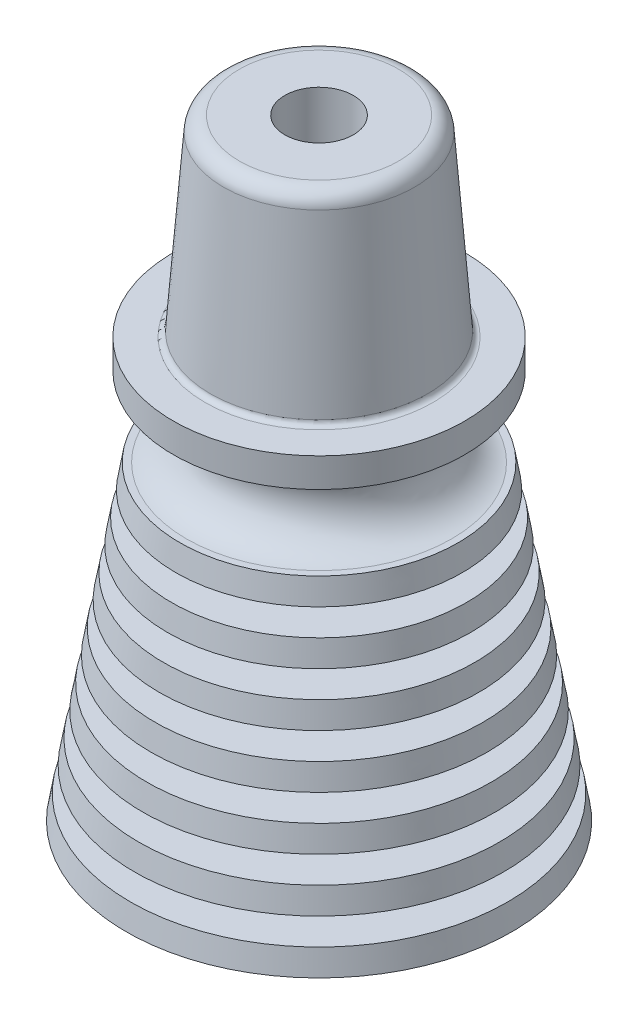
ISO-10303-21;
HEADER;
FILE_DESCRIPTION(('STEP AP214'),'2;1');
FILE_NAME('part.step','',(''),(''),'','','');
FILE_SCHEMA(('AUTOMOTIVE_DESIGN { 1 0 10303 214 1 1 1 1 }'));
ENDSEC;
DATA;
#1=APPLICATION_CONTEXT('core data for automotive mechanical design processes');
#2=APPLICATION_PROTOCOL_DEFINITION('international standard','automotive_design',2000,#1);
#3=PRODUCT_CONTEXT('',#1,'mechanical');
#4=PRODUCT('Part','Part','',(#3));
#5=PRODUCT_RELATED_PRODUCT_CATEGORY('part','',(#4));
#6=PRODUCT_DEFINITION_FORMATION('','',#4);
#7=PRODUCT_DEFINITION_CONTEXT('part definition',#1,'design');
#8=PRODUCT_DEFINITION('design','',#6,#7);
#9=PRODUCT_DEFINITION_SHAPE('','',#8);
#10=(LENGTH_UNIT() NAMED_UNIT(*) SI_UNIT(.MILLI.,.METRE.));
#11=(NAMED_UNIT(*) PLANE_ANGLE_UNIT() SI_UNIT($,.RADIAN.));
#12=(NAMED_UNIT(*) SI_UNIT($,.STERADIAN.) SOLID_ANGLE_UNIT());
#13=UNCERTAINTY_MEASURE_WITH_UNIT(LENGTH_MEASURE(1.E-05),#10,'distance_accuracy_value','');
#14=(GEOMETRIC_REPRESENTATION_CONTEXT(3) GLOBAL_UNCERTAINTY_ASSIGNED_CONTEXT((#13)) GLOBAL_UNIT_ASSIGNED_CONTEXT((#10,
#11,#12)) REPRESENTATION_CONTEXT('',''));
#15=CARTESIAN_POINT('',(0.,0.,0.));
#16=DIRECTION('',(0.,0.,1.));
#17=DIRECTION('',(1.,0.,0.));
#18=AXIS2_PLACEMENT_3D('',#15,#16,#17);
#19=CARTESIAN_POINT('',(0.,0.,0.));
#20=DIRECTION('',(0.,-1.,0.));
#21=DIRECTION('',(0.,0.,-1.));
#22=AXIS2_PLACEMENT_3D('',#19,#20,#21);
#23=CONICAL_SURFACE('',#22,6.23569725419736,0.111501419453793);
#24=CARTESIAN_POINT('',(0.,12.573,0.));
#25=DIRECTION('',(0.,1.,0.));
#26=DIRECTION('',(0.,0.,1.));
#27=AXIS2_PLACEMENT_3D('',#24,#25,#26);
#28=CIRCLE('',#27,4.82795110035121);
#29=CARTESIAN_POINT('',(0.,12.573,4.82795110035121));
#30=VERTEX_POINT('',#29);
#31=EDGE_CURVE('E55',#30,#30,#28,.F.);
#32=ORIENTED_EDGE('',*,*,#31,.F.);
#33=EDGE_LOOP('',(#32));
#34=FACE_BOUND('',#33,.T.);
#35=CARTESIAN_POINT('',(0.,13.716,0.));
#36=DIRECTION('',(0.,-1.,0.));
#37=DIRECTION('',(0.,0.,-1.));
#38=AXIS2_PLACEMENT_3D('',#35,#36,#37);
#39=CIRCLE('',#38,4.69997417727428);
#40=CARTESIAN_POINT('',(0.,13.716,-4.69997417727428));
#41=VERTEX_POINT('',#40);
#42=EDGE_CURVE('E88',#41,#41,#39,.F.);
#43=ORIENTED_EDGE('',*,*,#42,.F.);
#44=EDGE_LOOP('',(#43));
#45=FACE_BOUND('',#44,.T.);
#46=ADVANCED_FACE('F32',(#34,#45),#23,.T.);
#47=CARTESIAN_POINT('',(0.,9.144,0.));
#48=DIRECTION('',(0.,-1.,0.));
#49=DIRECTION('',(0.,0.,-1.));
#50=AXIS2_PLACEMENT_3D('',#47,#48,#49);
#51=CIRCLE('',#50,5.21188186958198);
#52=CARTESIAN_POINT('',(0.,9.144,-5.21188186958198));
#53=VERTEX_POINT('',#52);
#54=EDGE_CURVE('E61',#53,#53,#51,.F.);
#55=ORIENTED_EDGE('',*,*,#54,.F.);
#56=EDGE_LOOP('',(#55));
#57=FACE_BOUND('',#56,.T.);
#58=CARTESIAN_POINT('',(0.,8.001,0.));
#59=DIRECTION('',(0.,1.,0.));
#60=DIRECTION('',(0.,0.,1.));
#61=AXIS2_PLACEMENT_3D('',#58,#59,#60);
#62=CIRCLE('',#61,5.3398587926589);
#63=CARTESIAN_POINT('',(0.,8.001,5.3398587926589));
#64=VERTEX_POINT('',#63);
#65=EDGE_CURVE('E67',#64,#64,#62,.F.);
#66=ORIENTED_EDGE('',*,*,#65,.F.);
#67=EDGE_LOOP('',(#66));
#68=FACE_BOUND('',#67,.T.);
#69=ADVANCED_FACE('F172',(#57,#68),#23,.T.);
#70=CARTESIAN_POINT('',(0.,11.43,0.));
#71=DIRECTION('',(0.,-1.,0.));
#72=DIRECTION('',(0.,0.,-1.));
#73=AXIS2_PLACEMENT_3D('',#70,#71,#72);
#74=CIRCLE('',#73,4.95592802342813);
#75=CARTESIAN_POINT('',(0.,11.43,-4.95592802342813));
#76=VERTEX_POINT('',#75);
#77=EDGE_CURVE('E58',#76,#76,#74,.F.);
#78=ORIENTED_EDGE('',*,*,#77,.F.);
#79=EDGE_LOOP('',(#78));
#80=FACE_BOUND('',#79,.T.);
#81=CARTESIAN_POINT('',(0.,10.287,0.));
#82=DIRECTION('',(0.,1.,0.));
#83=DIRECTION('',(0.,0.,1.));
#84=AXIS2_PLACEMENT_3D('',#81,#82,#83);
#85=CIRCLE('',#84,5.08390494650505);
#86=CARTESIAN_POINT('',(0.,10.287,5.08390494650505));
#87=VERTEX_POINT('',#86);
#88=EDGE_CURVE('E64',#87,#87,#85,.F.);
#89=ORIENTED_EDGE('',*,*,#88,.F.);
#90=EDGE_LOOP('',(#89));
#91=FACE_BOUND('',#90,.T.);
#92=ADVANCED_FACE('F179',(#80,#91),#23,.T.);
#93=CARTESIAN_POINT('',(0.,6.858,0.));
#94=DIRECTION('',(0.,-1.,0.));
#95=DIRECTION('',(0.,0.,-1.));
#96=AXIS2_PLACEMENT_3D('',#93,#94,#95);
#97=CIRCLE('',#96,5.46783571573582);
#98=CARTESIAN_POINT('',(0.,6.858,-5.46783571573582));
#99=VERTEX_POINT('',#98);
#100=EDGE_CURVE('E70',#99,#99,#97,.F.);
#101=ORIENTED_EDGE('',*,*,#100,.F.);
#102=EDGE_LOOP('',(#101));
#103=FACE_BOUND('',#102,.T.);
#104=CARTESIAN_POINT('',(0.,5.715,0.));
#105=DIRECTION('',(0.,1.,0.));
#106=DIRECTION('',(0.,0.,1.));
#107=AXIS2_PLACEMENT_3D('',#104,#105,#106);
#108=CIRCLE('',#107,5.59581263881275);
#109=CARTESIAN_POINT('',(0.,5.715,5.59581263881275));
#110=VERTEX_POINT('',#109);
#111=EDGE_CURVE('E73',#110,#110,#108,.F.);
#112=ORIENTED_EDGE('',*,*,#111,.F.);
#113=EDGE_LOOP('',(#112));
#114=FACE_BOUND('',#113,.T.);
#115=ADVANCED_FACE('F201',(#103,#114),#23,.T.);
#116=CARTESIAN_POINT('',(0.,4.572,0.));
#117=DIRECTION('',(0.,-1.,0.));
#118=DIRECTION('',(0.,0.,-1.));
#119=AXIS2_PLACEMENT_3D('',#116,#117,#118);
#120=CIRCLE('',#119,5.72378956188967);
#121=CARTESIAN_POINT('',(0.,4.572,-5.72378956188967));
#122=VERTEX_POINT('',#121);
#123=EDGE_CURVE('E76',#122,#122,#120,.F.);
#124=ORIENTED_EDGE('',*,*,#123,.F.);
#125=EDGE_LOOP('',(#124));
#126=FACE_BOUND('',#125,.T.);
#127=CARTESIAN_POINT('',(0.,3.429,0.));
#128=DIRECTION('',(0.,1.,0.));
#129=DIRECTION('',(0.,0.,1.));
#130=AXIS2_PLACEMENT_3D('',#127,#128,#129);
#131=CIRCLE('',#130,5.85176648496659);
#132=CARTESIAN_POINT('',(0.,3.429,5.85176648496659));
#133=VERTEX_POINT('',#132);
#134=EDGE_CURVE('E79',#133,#133,#131,.F.);
#135=ORIENTED_EDGE('',*,*,#134,.F.);
#136=EDGE_LOOP('',(#135));
#137=FACE_BOUND('',#136,.T.);
#138=ADVANCED_FACE('F189',(#126,#137),#23,.T.);
#139=CARTESIAN_POINT('',(0.,14.859,0.));
#140=DIRECTION('',(0.,-1.,0.));
#141=DIRECTION('',(0.,0.,-1.));
#142=AXIS2_PLACEMENT_3D('',#139,#140,#141);
#143=CONICAL_SURFACE('',#142,2.5273,0.111501419453793);
#144=CARTESIAN_POINT('',(0.,0.,0.));
#145=DIRECTION('',(0.,-1.,0.));
#146=DIRECTION('',(0.,0.,-1.));
#147=AXIS2_PLACEMENT_3D('',#144,#145,#146);
#148=CIRCLE('',#147,4.191);
#149=CARTESIAN_POINT('',(0.,0.,-4.191));
#150=VERTEX_POINT('',#149);
#151=EDGE_CURVE('E91',#150,#150,#148,.T.);
#152=ORIENTED_EDGE('',*,*,#151,.T.);
#153=EDGE_LOOP('',(#152));
#154=FACE_BOUND('',#153,.T.);
#155=CARTESIAN_POINT('',(0.,14.859,0.));
#156=DIRECTION('',(0.,-1.,0.));
#157=DIRECTION('',(0.,0.,-1.));
#158=AXIS2_PLACEMENT_3D('',#155,#156,#157);
#159=CIRCLE('',#158,2.5273);
#160=CARTESIAN_POINT('',(0.,14.859,-2.5273));
#161=VERTEX_POINT('',#160);
#162=EDGE_CURVE('E94',#161,#161,#159,.T.);
#163=ORIENTED_EDGE('',*,*,#162,.F.);
#164=EDGE_LOOP('',(#163));
#165=FACE_BOUND('',#164,.T.);
#166=ADVANCED_FACE('F196',(#154,#165),#143,.F.);
#167=CARTESIAN_POINT('',(4.191,0.,0.));
#168=DIRECTION('',(0.,-1.,0.));
#169=DIRECTION('',(0.,0.,-1.));
#170=AXIS2_PLACEMENT_3D('',#167,#168,#169);
#171=PLANE('',#170);
#172=ORIENTED_EDGE('',*,*,#151,.F.);
#173=EDGE_LOOP('',(#172));
#174=FACE_BOUND('',#173,.T.);
#175=CARTESIAN_POINT('',(0.,0.,0.));
#176=DIRECTION('',(0.,-1.,0.));
#177=DIRECTION('',(0.,0.,-1.));
#178=AXIS2_PLACEMENT_3D('',#175,#176,#177);
#179=CIRCLE('',#178,9.2329);
#180=CARTESIAN_POINT('',(0.,0.,-9.2329));
#181=VERTEX_POINT('',#180);
#182=EDGE_CURVE('E106',#181,#181,#179,.T.);
#183=ORIENTED_EDGE('',*,*,#182,.T.);
#184=EDGE_LOOP('',(#183));
#185=FACE_BOUND('',#184,.T.);
#186=ADVANCED_FACE('F187',(#174,#185),#171,.T.);
#187=CARTESIAN_POINT('',(0.,2.286,0.));
#188=DIRECTION('',(0.,-1.,0.));
#189=DIRECTION('',(0.,0.,-1.));
#190=AXIS2_PLACEMENT_3D('',#187,#188,#189);
#191=CIRCLE('',#190,5.97974340804351);
#192=CARTESIAN_POINT('',(0.,2.286,-5.97974340804351));
#193=VERTEX_POINT('',#192);
#194=EDGE_CURVE('E82',#193,#193,#191,.F.);
#195=ORIENTED_EDGE('',*,*,#194,.F.);
#196=EDGE_LOOP('',(#195));
#197=FACE_BOUND('',#196,.T.);
#198=CARTESIAN_POINT('',(0.,1.143,0.));
#199=DIRECTION('',(0.,1.,0.));
#200=DIRECTION('',(0.,0.,1.));
#201=AXIS2_PLACEMENT_3D('',#198,#199,#200);
#202=CIRCLE('',#201,6.10772033112044);
#203=CARTESIAN_POINT('',(0.,1.143,6.10772033112044));
#204=VERTEX_POINT('',#203);
#205=EDGE_CURVE('E85',#204,#204,#202,.F.);
#206=ORIENTED_EDGE('',*,*,#205,.F.);
#207=EDGE_LOOP('',(#206));
#208=FACE_BOUND('',#207,.T.);
#209=ADVANCED_FACE('F175',(#197,#208),#23,.T.);
#210=CARTESIAN_POINT('',(4.57199725419736,14.859,0.));
#211=DIRECTION('',(0.,1.,0.));
#212=DIRECTION('',(0.,0.,1.));
#213=AXIS2_PLACEMENT_3D('',#210,#211,#212);
#214=PLANE('',#213);
#215=CARTESIAN_POINT('',(0.,14.859,0.));
#216=DIRECTION('',(0.,-1.,0.));
#217=DIRECTION('',(0.,0.,-1.));
#218=AXIS2_PLACEMENT_3D('',#215,#216,#217);
#219=CIRCLE('',#218,6.35000000000002);
#220=CARTESIAN_POINT('',(0.,14.859,-6.35000000000002));
#221=VERTEX_POINT('',#220);
#222=EDGE_CURVE('E52',#221,#221,#219,.F.);
#223=ORIENTED_EDGE('',*,*,#222,.F.);
#224=EDGE_LOOP('',(#223));
#225=FACE_BOUND('',#224,.T.);
#226=CARTESIAN_POINT('',(0.,14.859,0.));
#227=DIRECTION('',(0.,-1.,0.));
#228=DIRECTION('',(0.,0.,-1.));
#229=AXIS2_PLACEMENT_3D('',#226,#227,#228);
#230=CIRCLE('',#229,6.6675);
#231=CARTESIAN_POINT('',(0.,14.859,-6.6675));
#232=VERTEX_POINT('',#231);
#233=EDGE_CURVE('E97',#232,#232,#230,.T.);
#234=ORIENTED_EDGE('',*,*,#233,.F.);
#235=EDGE_LOOP('',(#234));
#236=FACE_BOUND('',#235,.T.);
#237=ADVANCED_FACE('F186',(#225,#236),#214,.T.);
#238=CARTESIAN_POINT('',(0.,13.716,0.));
#239=DIRECTION('',(0.,-1.,0.));
#240=DIRECTION('',(0.,0.,-1.));
#241=AXIS2_PLACEMENT_3D('',#238,#239,#240);
#242=CONICAL_SURFACE('',#241,6.86483846153846,0.170964175409462);
#243=ORIENTED_EDGE('',*,*,#233,.T.);
#244=EDGE_LOOP('',(#243));
#245=FACE_BOUND('',#244,.T.);
#246=CARTESIAN_POINT('',(0.,13.716,0.));
#247=DIRECTION('',(0.,-1.,0.));
#248=DIRECTION('',(0.,0.,-1.));
#249=AXIS2_PLACEMENT_3D('',#246,#247,#248);
#250=CIRCLE('',#249,6.86483846153846);
#251=CARTESIAN_POINT('',(0.,13.716,-6.86483846153846));
#252=VERTEX_POINT('',#251);
#253=EDGE_CURVE('E100',#252,#252,#250,.T.);
#254=ORIENTED_EDGE('',*,*,#253,.F.);
#255=EDGE_LOOP('',(#254));
#256=FACE_BOUND('',#255,.T.);
#257=ADVANCED_FACE('F194',(#245,#256),#242,.T.);
#258=CARTESIAN_POINT('',(4.69997417727428,13.716,0.));
#259=DIRECTION('',(0.,-1.,0.));
#260=DIRECTION('',(0.,0.,-1.));
#261=AXIS2_PLACEMENT_3D('',#258,#259,#260);
#262=PLANE('',#261);
#263=ORIENTED_EDGE('',*,*,#253,.T.);
#264=EDGE_LOOP('',(#263));
#265=FACE_BOUND('',#264,.T.);
#266=ORIENTED_EDGE('',*,*,#42,.T.);
#267=EDGE_LOOP('',(#266));
#268=FACE_BOUND('',#267,.T.);
#269=ADVANCED_FACE('F246',(#265,#268),#262,.T.);
#270=CARTESIAN_POINT('',(0.,0.,0.));
#271=DIRECTION('',(0.,-1.,0.));
#272=DIRECTION('',(0.,0.,-1.));
#273=AXIS2_PLACEMENT_3D('',#270,#271,#272);
#274=CONICAL_SURFACE('',#273,9.2329,0.170964175409462);
#275=CARTESIAN_POINT('',(0.,1.143,0.));
#276=DIRECTION('',(0.,-1.,0.));
#277=DIRECTION('',(0.,0.,-1.));
#278=AXIS2_PLACEMENT_3D('',#275,#276,#277);
#279=CIRCLE('',#278,9.03556153846154);
#280=CARTESIAN_POINT('',(0.,1.143,-9.03556153846154));
#281=VERTEX_POINT('',#280);
#282=EDGE_CURVE('E103',#281,#281,#279,.T.);
#283=ORIENTED_EDGE('',*,*,#282,.T.);
#284=EDGE_LOOP('',(#283));
#285=FACE_BOUND('',#284,.T.);
#286=ORIENTED_EDGE('',*,*,#182,.F.);
#287=EDGE_LOOP('',(#286));
#288=FACE_BOUND('',#287,.T.);
#289=ADVANCED_FACE('F242',(#285,#288),#274,.T.);
#290=CARTESIAN_POINT('',(6.10772033112044,1.143,0.));
#291=DIRECTION('',(0.,1.,0.));
#292=DIRECTION('',(0.,0.,1.));
#293=AXIS2_PLACEMENT_3D('',#290,#291,#292);
#294=PLANE('',#293);
#295=ORIENTED_EDGE('',*,*,#205,.T.);
#296=EDGE_LOOP('',(#295));
#297=FACE_BOUND('',#296,.T.);
#298=ORIENTED_EDGE('',*,*,#282,.F.);
#299=EDGE_LOOP('',(#298));
#300=FACE_BOUND('',#299,.T.);
#301=ADVANCED_FACE('F224',(#297,#300),#294,.T.);
#302=CARTESIAN_POINT('',(0.,2.286,0.));
#303=DIRECTION('',(0.,-1.,0.));
#304=DIRECTION('',(0.,0.,-1.));
#305=AXIS2_PLACEMENT_3D('',#302,#303,#304);
#306=CONICAL_SURFACE('',#305,8.83822307692308,0.170964175409462);
#307=CARTESIAN_POINT('',(0.,3.429,0.));
#308=DIRECTION('',(0.,-1.,0.));
#309=DIRECTION('',(0.,0.,-1.));
#310=AXIS2_PLACEMENT_3D('',#307,#308,#309);
#311=CIRCLE('',#310,8.64088461538461);
#312=CARTESIAN_POINT('',(0.,3.429,-8.64088461538461));
#313=VERTEX_POINT('',#312);
#314=EDGE_CURVE('E109',#313,#313,#311,.T.);
#315=ORIENTED_EDGE('',*,*,#314,.T.);
#316=EDGE_LOOP('',(#315));
#317=FACE_BOUND('',#316,.T.);
#318=CARTESIAN_POINT('',(0.,2.286,0.));
#319=DIRECTION('',(0.,-1.,0.));
#320=DIRECTION('',(0.,0.,-1.));
#321=AXIS2_PLACEMENT_3D('',#318,#319,#320);
#322=CIRCLE('',#321,8.83822307692308);
#323=CARTESIAN_POINT('',(0.,2.286,-8.83822307692308));
#324=VERTEX_POINT('',#323);
#325=EDGE_CURVE('E112',#324,#324,#322,.T.);
#326=ORIENTED_EDGE('',*,*,#325,.F.);
#327=EDGE_LOOP('',(#326));
#328=FACE_BOUND('',#327,.T.);
#329=ADVANCED_FACE('F218',(#317,#328),#306,.T.);
#330=CARTESIAN_POINT('',(5.85176648496659,3.429,0.));
#331=DIRECTION('',(0.,1.,0.));
#332=DIRECTION('',(0.,0.,1.));
#333=AXIS2_PLACEMENT_3D('',#330,#331,#332);
#334=PLANE('',#333);
#335=ORIENTED_EDGE('',*,*,#134,.T.);
#336=EDGE_LOOP('',(#335));
#337=FACE_BOUND('',#336,.T.);
#338=ORIENTED_EDGE('',*,*,#314,.F.);
#339=EDGE_LOOP('',(#338));
#340=FACE_BOUND('',#339,.T.);
#341=ADVANCED_FACE('F214',(#337,#340),#334,.T.);
#342=CARTESIAN_POINT('',(5.97974340804352,2.286,0.));
#343=DIRECTION('',(0.,-1.,0.));
#344=DIRECTION('',(0.,0.,-1.));
#345=AXIS2_PLACEMENT_3D('',#342,#343,#344);
#346=PLANE('',#345);
#347=ORIENTED_EDGE('',*,*,#325,.T.);
#348=EDGE_LOOP('',(#347));
#349=FACE_BOUND('',#348,.T.);
#350=ORIENTED_EDGE('',*,*,#194,.T.);
#351=EDGE_LOOP('',(#350));
#352=FACE_BOUND('',#351,.T.);
#353=ADVANCED_FACE('F217',(#349,#352),#346,.T.);
#354=CARTESIAN_POINT('',(0.,4.572,0.));
#355=DIRECTION('',(0.,-1.,0.));
#356=DIRECTION('',(0.,0.,-1.));
#357=AXIS2_PLACEMENT_3D('',#354,#355,#356);
#358=CONICAL_SURFACE('',#357,8.44354615384615,0.17096417540946);
#359=CARTESIAN_POINT('',(0.,5.715,0.));
#360=DIRECTION('',(0.,-1.,0.));
#361=DIRECTION('',(0.,0.,-1.));
#362=AXIS2_PLACEMENT_3D('',#359,#360,#361);
#363=CIRCLE('',#362,8.24620769230769);
#364=CARTESIAN_POINT('',(0.,5.715,-8.24620769230769));
#365=VERTEX_POINT('',#364);
#366=EDGE_CURVE('E115',#365,#365,#363,.T.);
#367=ORIENTED_EDGE('',*,*,#366,.T.);
#368=EDGE_LOOP('',(#367));
#369=FACE_BOUND('',#368,.T.);
#370=CARTESIAN_POINT('',(0.,4.572,0.));
#371=DIRECTION('',(0.,-1.,0.));
#372=DIRECTION('',(0.,0.,-1.));
#373=AXIS2_PLACEMENT_3D('',#370,#371,#372);
#374=CIRCLE('',#373,8.44354615384615);
#375=CARTESIAN_POINT('',(0.,4.572,-8.44354615384615));
#376=VERTEX_POINT('',#375);
#377=EDGE_CURVE('E118',#376,#376,#374,.T.);
#378=ORIENTED_EDGE('',*,*,#377,.F.);
#379=EDGE_LOOP('',(#378));
#380=FACE_BOUND('',#379,.T.);
#381=ADVANCED_FACE('F230',(#369,#380),#358,.T.);
#382=CARTESIAN_POINT('',(5.59581263881275,5.715,0.));
#383=DIRECTION('',(0.,1.,0.));
#384=DIRECTION('',(0.,0.,1.));
#385=AXIS2_PLACEMENT_3D('',#382,#383,#384);
#386=PLANE('',#385);
#387=ORIENTED_EDGE('',*,*,#111,.T.);
#388=EDGE_LOOP('',(#387));
#389=FACE_BOUND('',#388,.T.);
#390=ORIENTED_EDGE('',*,*,#366,.F.);
#391=EDGE_LOOP('',(#390));
#392=FACE_BOUND('',#391,.T.);
#393=ADVANCED_FACE('F235',(#389,#392),#386,.T.);
#394=CARTESIAN_POINT('',(5.72378956188967,4.572,0.));
#395=DIRECTION('',(0.,-1.,0.));
#396=DIRECTION('',(0.,0.,-1.));
#397=AXIS2_PLACEMENT_3D('',#394,#395,#396);
#398=PLANE('',#397);
#399=ORIENTED_EDGE('',*,*,#377,.T.);
#400=EDGE_LOOP('',(#399));
#401=FACE_BOUND('',#400,.T.);
#402=ORIENTED_EDGE('',*,*,#123,.T.);
#403=EDGE_LOOP('',(#402));
#404=FACE_BOUND('',#403,.T.);
#405=ADVANCED_FACE('F302',(#401,#404),#398,.T.);
#406=CARTESIAN_POINT('',(0.,6.858,0.));
#407=DIRECTION('',(0.,-1.,0.));
#408=DIRECTION('',(0.,0.,-1.));
#409=AXIS2_PLACEMENT_3D('',#406,#407,#408);
#410=CONICAL_SURFACE('',#409,8.04886923076923,0.170964175409462);
#411=CARTESIAN_POINT('',(0.,8.001,0.));
#412=DIRECTION('',(0.,-1.,0.));
#413=DIRECTION('',(0.,0.,-1.));
#414=AXIS2_PLACEMENT_3D('',#411,#412,#413);
#415=CIRCLE('',#414,7.85153076923077);
#416=CARTESIAN_POINT('',(0.,8.001,-7.85153076923077));
#417=VERTEX_POINT('',#416);
#418=EDGE_CURVE('E121',#417,#417,#415,.T.);
#419=ORIENTED_EDGE('',*,*,#418,.T.);
#420=EDGE_LOOP('',(#419));
#421=FACE_BOUND('',#420,.T.);
#422=CARTESIAN_POINT('',(0.,6.858,0.));
#423=DIRECTION('',(0.,-1.,0.));
#424=DIRECTION('',(0.,0.,-1.));
#425=AXIS2_PLACEMENT_3D('',#422,#423,#424);
#426=CIRCLE('',#425,8.04886923076923);
#427=CARTESIAN_POINT('',(0.,6.858,-8.04886923076923));
#428=VERTEX_POINT('',#427);
#429=EDGE_CURVE('E124',#428,#428,#426,.T.);
#430=ORIENTED_EDGE('',*,*,#429,.F.);
#431=EDGE_LOOP('',(#430));
#432=FACE_BOUND('',#431,.T.);
#433=ADVANCED_FACE('F311',(#421,#432),#410,.T.);
#434=CARTESIAN_POINT('',(5.3398587926589,8.001,0.));
#435=DIRECTION('',(0.,1.,0.));
#436=DIRECTION('',(0.,0.,1.));
#437=AXIS2_PLACEMENT_3D('',#434,#435,#436);
#438=PLANE('',#437);
#439=ORIENTED_EDGE('',*,*,#65,.T.);
#440=EDGE_LOOP('',(#439));
#441=FACE_BOUND('',#440,.T.);
#442=ORIENTED_EDGE('',*,*,#418,.F.);
#443=EDGE_LOOP('',(#442));
#444=FACE_BOUND('',#443,.T.);
#445=ADVANCED_FACE('F321',(#441,#444),#438,.T.);
#446=CARTESIAN_POINT('',(5.46783571573582,6.858,0.));
#447=DIRECTION('',(0.,-1.,0.));
#448=DIRECTION('',(0.,0.,-1.));
#449=AXIS2_PLACEMENT_3D('',#446,#447,#448);
#450=PLANE('',#449);
#451=ORIENTED_EDGE('',*,*,#429,.T.);
#452=EDGE_LOOP('',(#451));
#453=FACE_BOUND('',#452,.T.);
#454=ORIENTED_EDGE('',*,*,#100,.T.);
#455=EDGE_LOOP('',(#454));
#456=FACE_BOUND('',#455,.T.);
#457=ADVANCED_FACE('F331',(#453,#456),#450,.T.);
#458=CARTESIAN_POINT('',(5.21188186958198,9.144,0.));
#459=DIRECTION('',(0.,-1.,0.));
#460=DIRECTION('',(0.,0.,-1.));
#461=AXIS2_PLACEMENT_3D('',#458,#459,#460);
#462=PLANE('',#461);
#463=CARTESIAN_POINT('',(0.,9.144,0.));
#464=DIRECTION('',(0.,-1.,0.));
#465=DIRECTION('',(0.,0.,-1.));
#466=AXIS2_PLACEMENT_3D('',#463,#464,#465);
#467=CIRCLE('',#466,7.65419230769231);
#468=CARTESIAN_POINT('',(0.,9.144,-7.65419230769231));
#469=VERTEX_POINT('',#468);
#470=EDGE_CURVE('E127',#469,#469,#467,.T.);
#471=ORIENTED_EDGE('',*,*,#470,.T.);
#472=EDGE_LOOP('',(#471));
#473=FACE_BOUND('',#472,.T.);
#474=ORIENTED_EDGE('',*,*,#54,.T.);
#475=EDGE_LOOP('',(#474));
#476=FACE_BOUND('',#475,.T.);
#477=ADVANCED_FACE('F341',(#473,#476),#462,.T.);
#478=CARTESIAN_POINT('',(0.,9.144,0.));
#479=DIRECTION('',(0.,-1.,0.));
#480=DIRECTION('',(0.,0.,-1.));
#481=AXIS2_PLACEMENT_3D('',#478,#479,#480);
#482=CONICAL_SURFACE('',#481,7.65419230769231,0.170964175409462);
#483=CARTESIAN_POINT('',(0.,10.287,0.));
#484=DIRECTION('',(0.,-1.,0.));
#485=DIRECTION('',(0.,0.,-1.));
#486=AXIS2_PLACEMENT_3D('',#483,#484,#485);
#487=CIRCLE('',#486,7.45685384615385);
#488=CARTESIAN_POINT('',(0.,10.287,-7.45685384615385));
#489=VERTEX_POINT('',#488);
#490=EDGE_CURVE('E130',#489,#489,#487,.T.);
#491=ORIENTED_EDGE('',*,*,#490,.T.);
#492=EDGE_LOOP('',(#491));
#493=FACE_BOUND('',#492,.T.);
#494=ORIENTED_EDGE('',*,*,#470,.F.);
#495=EDGE_LOOP('',(#494));
#496=FACE_BOUND('',#495,.T.);
#497=ADVANCED_FACE('F351',(#493,#496),#482,.T.);
#498=CARTESIAN_POINT('',(5.08390494650505,10.287,0.));
#499=DIRECTION('',(0.,1.,0.));
#500=DIRECTION('',(0.,0.,1.));
#501=AXIS2_PLACEMENT_3D('',#498,#499,#500);
#502=PLANE('',#501);
#503=ORIENTED_EDGE('',*,*,#88,.T.);
#504=EDGE_LOOP('',(#503));
#505=FACE_BOUND('',#504,.T.);
#506=ORIENTED_EDGE('',*,*,#490,.F.);
#507=EDGE_LOOP('',(#506));
#508=FACE_BOUND('',#507,.T.);
#509=ADVANCED_FACE('F361',(#505,#508),#502,.T.);
#510=CARTESIAN_POINT('',(0.,11.43,0.));
#511=DIRECTION('',(0.,-1.,0.));
#512=DIRECTION('',(0.,0.,-1.));
#513=AXIS2_PLACEMENT_3D('',#510,#511,#512);
#514=CONICAL_SURFACE('',#513,7.25951538461538,0.170964175409461);
#515=CARTESIAN_POINT('',(0.,12.573,0.));
#516=DIRECTION('',(0.,-1.,0.));
#517=DIRECTION('',(0.,0.,-1.));
#518=AXIS2_PLACEMENT_3D('',#515,#516,#517);
#519=CIRCLE('',#518,7.06217692307692);
#520=CARTESIAN_POINT('',(0.,12.573,-7.06217692307692));
#521=VERTEX_POINT('',#520);
#522=EDGE_CURVE('E133',#521,#521,#519,.T.);
#523=ORIENTED_EDGE('',*,*,#522,.T.);
#524=EDGE_LOOP('',(#523));
#525=FACE_BOUND('',#524,.T.);
#526=CARTESIAN_POINT('',(0.,11.43,0.));
#527=DIRECTION('',(0.,-1.,0.));
#528=DIRECTION('',(0.,0.,-1.));
#529=AXIS2_PLACEMENT_3D('',#526,#527,#528);
#530=CIRCLE('',#529,7.25951538461538);
#531=CARTESIAN_POINT('',(0.,11.43,-7.25951538461538));
#532=VERTEX_POINT('',#531);
#533=EDGE_CURVE('E136',#532,#532,#530,.T.);
#534=ORIENTED_EDGE('',*,*,#533,.F.);
#535=EDGE_LOOP('',(#534));
#536=FACE_BOUND('',#535,.T.);
#537=ADVANCED_FACE('F371',(#525,#536),#514,.T.);
#538=CARTESIAN_POINT('',(4.82795110035121,12.573,0.));
#539=DIRECTION('',(0.,1.,0.));
#540=DIRECTION('',(0.,0.,1.));
#541=AXIS2_PLACEMENT_3D('',#538,#539,#540);
#542=PLANE('',#541);
#543=ORIENTED_EDGE('',*,*,#31,.T.);
#544=EDGE_LOOP('',(#543));
#545=FACE_BOUND('',#544,.T.);
#546=ORIENTED_EDGE('',*,*,#522,.F.);
#547=EDGE_LOOP('',(#546));
#548=FACE_BOUND('',#547,.T.);
#549=ADVANCED_FACE('F381',(#545,#548),#542,.T.);
#550=CARTESIAN_POINT('',(4.95592802342813,11.43,0.));
#551=DIRECTION('',(0.,-1.,0.));
#552=DIRECTION('',(0.,0.,-1.));
#553=AXIS2_PLACEMENT_3D('',#550,#551,#552);
#554=PLANE('',#553);
#555=ORIENTED_EDGE('',*,*,#533,.T.);
#556=EDGE_LOOP('',(#555));
#557=FACE_BOUND('',#556,.T.);
#558=ORIENTED_EDGE('',*,*,#77,.T.);
#559=EDGE_LOOP('',(#558));
#560=FACE_BOUND('',#559,.T.);
#561=ADVANCED_FACE('F391',(#557,#560),#554,.T.);
#562=CARTESIAN_POINT('',(0.,20.066,0.));
#563=DIRECTION('',(0.,1.,0.));
#564=DIRECTION('',(0.,0.,1.));
#565=AXIS2_PLACEMENT_3D('',#562,#563,#564);
#566=PLANE('',#565);
#567=CARTESIAN_POINT('',(0.,20.066,0.));
#568=DIRECTION('',(0.,1.,0.));
#569=DIRECTION('',(0.,0.,1.));
#570=AXIS2_PLACEMENT_3D('',#567,#568,#569);
#571=CIRCLE('',#570,5.45513627775538);
#572=CARTESIAN_POINT('',(0.,20.066,5.45513627775538));
#573=VERTEX_POINT('',#572);
#574=EDGE_CURVE('E10',#573,#573,#571,.F.);
#575=ORIENTED_EDGE('',*,*,#574,.T.);
#576=EDGE_LOOP('',(#575));
#577=FACE_BOUND('',#576,.T.);
#578=CARTESIAN_POINT('',(0.,20.066,0.));
#579=DIRECTION('',(0.,-1.,0.));
#580=DIRECTION('',(0.,0.,-1.));
#581=AXIS2_PLACEMENT_3D('',#578,#579,#580);
#582=CIRCLE('',#581,6.985);
#583=CARTESIAN_POINT('',(0.,20.066,-6.985));
#584=VERTEX_POINT('',#583);
#585=EDGE_CURVE('E145',#584,#584,#582,.T.);
#586=ORIENTED_EDGE('',*,*,#585,.F.);
#587=EDGE_LOOP('',(#586));
#588=FACE_BOUND('',#587,.T.);
#589=ADVANCED_FACE('F400',(#577,#588),#566,.T.);
#590=CARTESIAN_POINT('',(0.,0.,0.));
#591=DIRECTION('',(0.,-1.,0.));
#592=DIRECTION('',(0.,0.,-1.));
#593=AXIS2_PLACEMENT_3D('',#590,#591,#592);
#594=CYLINDRICAL_SURFACE('',#593,6.985);
#595=ORIENTED_EDGE('',*,*,#585,.T.);
#596=EDGE_LOOP('',(#595));
#597=FACE_BOUND('',#596,.T.);
#598=CARTESIAN_POINT('',(0.,18.669,0.));
#599=DIRECTION('',(0.,-1.,0.));
#600=DIRECTION('',(0.,0.,-1.));
#601=AXIS2_PLACEMENT_3D('',#598,#599,#600);
#602=CIRCLE('',#601,6.985);
#603=CARTESIAN_POINT('',(0.,18.669,-6.985));
#604=VERTEX_POINT('',#603);
#605=EDGE_CURVE('E142',#604,#604,#602,.T.);
#606=ORIENTED_EDGE('',*,*,#605,.F.);
#607=EDGE_LOOP('',(#606));
#608=FACE_BOUND('',#607,.T.);
#609=ADVANCED_FACE('F415',(#597,#608),#594,.T.);
#610=CARTESIAN_POINT('',(6.35,18.669,0.));
#611=DIRECTION('',(0.,-1.,0.));
#612=DIRECTION('',(0.,0.,-1.));
#613=AXIS2_PLACEMENT_3D('',#610,#611,#612);
#614=PLANE('',#613);
#615=ORIENTED_EDGE('',*,*,#605,.T.);
#616=EDGE_LOOP('',(#615));
#617=FACE_BOUND('',#616,.T.);
#618=CARTESIAN_POINT('',(0.,18.669,0.));
#619=DIRECTION('',(0.,-1.,0.));
#620=DIRECTION('',(0.,0.,-1.));
#621=AXIS2_PLACEMENT_3D('',#618,#619,#620);
#622=CIRCLE('',#621,6.35);
#623=CARTESIAN_POINT('',(0.,18.669,-6.35));
#624=VERTEX_POINT('',#623);
#625=EDGE_CURVE('E139',#624,#624,#622,.T.);
#626=ORIENTED_EDGE('',*,*,#625,.F.);
#627=EDGE_LOOP('',(#626));
#628=FACE_BOUND('',#627,.T.);
#629=ADVANCED_FACE('F420',(#617,#628),#614,.T.);
#630=CARTESIAN_POINT('',(0.,16.764,0.));
#631=DIRECTION('',(0.,-1.,0.));
#632=DIRECTION('',(0.,0.,-1.));
#633=AXIS2_PLACEMENT_3D('',#630,#631,#632);
#634=TOROIDAL_SURFACE('',#633,6.60879885496183,1.92249885496183);
#635=ORIENTED_EDGE('',*,*,#625,.T.);
#636=EDGE_LOOP('',(#635));
#637=FACE_BOUND('',#636,.T.);
#638=ORIENTED_EDGE('',*,*,#222,.T.);
#639=EDGE_LOOP('',(#638));
#640=FACE_BOUND('',#639,.T.);
#641=ADVANCED_FACE('F430',(#637,#640),#634,.F.);
#642=CARTESIAN_POINT('',(6.35,14.859,0.));
#643=DIRECTION('',(0.,-1.,0.));
#644=DIRECTION('',(0.,0.,-1.));
#645=AXIS2_PLACEMENT_3D('',#642,#643,#644);
#646=PLANE('',#645);
#647=CARTESIAN_POINT('',(0.,14.859,0.));
#648=DIRECTION('',(0.,-1.,0.));
#649=DIRECTION('',(0.,0.,-1.));
#650=AXIS2_PLACEMENT_3D('',#647,#648,#649);
#651=CIRCLE('',#650,1.6383);
#652=CARTESIAN_POINT('',(0.,14.859,-1.6383));
#653=VERTEX_POINT('',#652);
#654=EDGE_CURVE('E148',#653,#653,#651,.T.);
#655=ORIENTED_EDGE('',*,*,#654,.F.);
#656=EDGE_LOOP('',(#655));
#657=FACE_BOUND('',#656,.T.);
#658=ORIENTED_EDGE('',*,*,#162,.T.);
#659=EDGE_LOOP('',(#658));
#660=FACE_BOUND('',#659,.T.);
#661=ADVANCED_FACE('F169',(#657,#660),#646,.T.);
#662=CARTESIAN_POINT('',(0.,20.066,0.));
#663=DIRECTION('',(0.,-1.,0.));
#664=DIRECTION('',(0.,0.,-1.));
#665=AXIS2_PLACEMENT_3D('',#662,#663,#664);
#666=CONICAL_SURFACE('',#665,5.2197,0.0758212208051455);
#667=CARTESIAN_POINT('',(0.,20.3007598570939,0.));
#668=DIRECTION('',(0.,-1.,0.));
#669=DIRECTION('',(0.,0.,-1.));
#670=AXIS2_PLACEMENT_3D('',#667,#668,#669);
#671=CIRCLE('',#670,5.20186603295557);
#672=CARTESIAN_POINT('',(0.,20.3007598570939,-5.20186603295557));
#673=VERTEX_POINT('',#672);
#674=EDGE_CURVE('E39',#673,#673,#671,.F.);
#675=ORIENTED_EDGE('',*,*,#674,.T.);
#676=EDGE_LOOP('',(#675));
#677=FACE_BOUND('',#676,.T.);
#678=CARTESIAN_POINT('',(0.,28.5565204287182,0.));
#679=DIRECTION('',(0.,1.,0.));
#680=DIRECTION('',(0.,0.,1.));
#681=AXIS2_PLACEMENT_3D('',#678,#679,#680);
#682=CIRCLE('',#681,4.57470190113329);
#683=CARTESIAN_POINT('',(0.,28.5565204287182,4.57470190113329));
#684=VERTEX_POINT('',#683);
#685=EDGE_CURVE('E47',#684,#684,#682,.F.);
#686=ORIENTED_EDGE('',*,*,#685,.T.);
#687=EDGE_LOOP('',(#686));
#688=FACE_BOUND('',#687,.T.);
#689=ADVANCED_FACE('F159',(#677,#688),#666,.T.);
#690=CARTESIAN_POINT('',(0.,29.2608,0.));
#691=DIRECTION('',(0.,1.,0.));
#692=DIRECTION('',(0.,0.,1.));
#693=AXIS2_PLACEMENT_3D('',#690,#691,#692);
#694=PLANE('',#693);
#695=CARTESIAN_POINT('',(0.,29.2608,0.));
#696=DIRECTION('',(0.,1.,0.));
#697=DIRECTION('',(0.,0.,1.));
#698=AXIS2_PLACEMENT_3D('',#695,#696,#697);
#699=CIRCLE('',#698,3.81489116673386);
#700=CARTESIAN_POINT('',(0.,29.2608,3.81489116673386));
#701=VERTEX_POINT('',#700);
#702=EDGE_CURVE('E43',#701,#701,#699,.T.);
#703=ORIENTED_EDGE('',*,*,#702,.T.);
#704=EDGE_LOOP('',(#703));
#705=FACE_BOUND('',#704,.T.);
#706=CARTESIAN_POINT('',(0.,29.2608,0.));
#707=DIRECTION('',(0.,1.,0.));
#708=DIRECTION('',(0.,0.,1.));
#709=AXIS2_PLACEMENT_3D('',#706,#707,#708);
#710=CIRCLE('',#709,1.6383);
#711=CARTESIAN_POINT('',(0.,29.2608,1.6383));
#712=VERTEX_POINT('',#711);
#713=EDGE_CURVE('E151',#712,#712,#710,.T.);
#714=ORIENTED_EDGE('',*,*,#713,.F.);
#715=EDGE_LOOP('',(#714));
#716=FACE_BOUND('',#715,.T.);
#717=ADVANCED_FACE('F157',(#705,#716),#694,.T.);
#718=CARTESIAN_POINT('',(0.,0.,0.));
#719=DIRECTION('',(0.,1.,0.));
#720=DIRECTION('',(0.,0.,1.));
#721=AXIS2_PLACEMENT_3D('',#718,#719,#720);
#722=CYLINDRICAL_SURFACE('',#721,1.6383);
#723=ORIENTED_EDGE('',*,*,#654,.T.);
#724=EDGE_LOOP('',(#723));
#725=FACE_BOUND('',#724,.T.);
#726=ORIENTED_EDGE('',*,*,#713,.T.);
#727=EDGE_LOOP('',(#726));
#728=FACE_BOUND('',#727,.T.);
#729=ADVANCED_FACE('F155',(#725,#728),#722,.F.);
#730=CARTESIAN_POINT('',(0.,28.4988,0.));
#731=DIRECTION('',(0.,1.,0.));
#732=DIRECTION('',(0.,0.,1.));
#733=AXIS2_PLACEMENT_3D('',#730,#731,#732);
#734=TOROIDAL_SURFACE('',#733,3.81489116673386,0.762);
#735=ORIENTED_EDGE('',*,*,#702,.F.);
#736=EDGE_LOOP('',(#735));
#737=FACE_BOUND('',#736,.T.);
#738=ORIENTED_EDGE('',*,*,#685,.F.);
#739=EDGE_LOOP('',(#738));
#740=FACE_BOUND('',#739,.T.);
#741=ADVANCED_FACE('F166',(#737,#740),#734,.T.);
#742=CARTESIAN_POINT('',(0.,20.32,0.));
#743=DIRECTION('',(0.,1.,0.));
#744=DIRECTION('',(0.,0.,1.));
#745=AXIS2_PLACEMENT_3D('',#742,#743,#744);
#746=TOROIDAL_SURFACE('',#745,5.45513627775538,0.254);
#747=ORIENTED_EDGE('',*,*,#574,.F.);
#748=EDGE_LOOP('',(#747));
#749=FACE_BOUND('',#748,.T.);
#750=ORIENTED_EDGE('',*,*,#674,.F.);
#751=EDGE_LOOP('',(#750));
#752=FACE_BOUND('',#751,.T.);
#753=ADVANCED_FACE('F34',(#749,#752),#746,.F.);
#754=CLOSED_SHELL('',(#46,#69,#92,#115,#138,#166,#186,#209,#237,#257,#269,#289,#301,#329,#341,
#353,#381,#393,#405,#433,#445,#457,#477,#497,#509,#537,#549,#561,#589,#609,#629,#641,#661,#689,
#717,#729,#741,#753));
#755=MANIFOLD_SOLID_BREP('B2',#754);
#756=ADVANCED_BREP_SHAPE_REPRESENTATION('',(#18,#755),#14);
#757=SHAPE_DEFINITION_REPRESENTATION(#9,#756);
ENDSEC;
END-ISO-10303-21;
